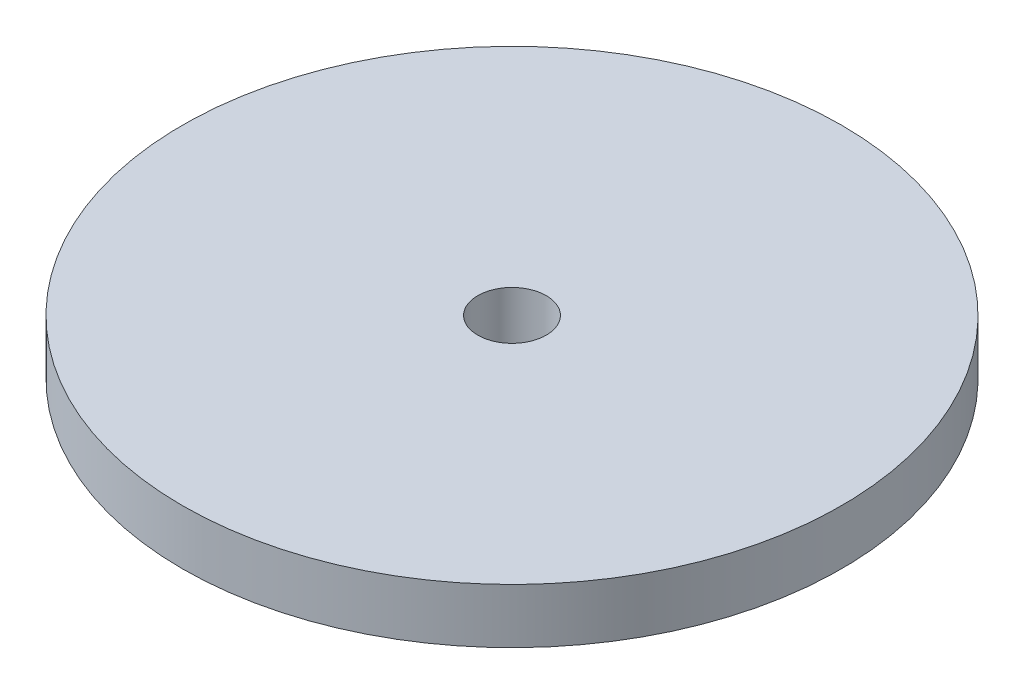
ISO-10303-21;
HEADER;
FILE_DESCRIPTION(('STEP AP214'),'2;1');
FILE_NAME('part.step','',(''),(''),'','','');
FILE_SCHEMA(('AUTOMOTIVE_DESIGN { 1 0 10303 214 1 1 1 1 }'));
ENDSEC;
DATA;
#1=APPLICATION_CONTEXT('core data for automotive mechanical design processes');
#2=APPLICATION_PROTOCOL_DEFINITION('international standard','automotive_design',2000,#1);
#3=PRODUCT_CONTEXT('',#1,'mechanical');
#4=PRODUCT('Part','Part','',(#3));
#5=PRODUCT_RELATED_PRODUCT_CATEGORY('part','',(#4));
#6=PRODUCT_DEFINITION_FORMATION('','',#4);
#7=PRODUCT_DEFINITION_CONTEXT('part definition',#1,'design');
#8=PRODUCT_DEFINITION('design','',#6,#7);
#9=PRODUCT_DEFINITION_SHAPE('','',#8);
#10=(LENGTH_UNIT() NAMED_UNIT(*) SI_UNIT(.MILLI.,.METRE.));
#11=(NAMED_UNIT(*) PLANE_ANGLE_UNIT() SI_UNIT($,.RADIAN.));
#12=(NAMED_UNIT(*) SI_UNIT($,.STERADIAN.) SOLID_ANGLE_UNIT());
#13=UNCERTAINTY_MEASURE_WITH_UNIT(LENGTH_MEASURE(1.E-05),#10,'distance_accuracy_value','');
#14=(GEOMETRIC_REPRESENTATION_CONTEXT(3) GLOBAL_UNCERTAINTY_ASSIGNED_CONTEXT((#13)) GLOBAL_UNIT_ASSIGNED_CONTEXT((#10,
#11,#12)) REPRESENTATION_CONTEXT('',''));
#15=CARTESIAN_POINT('',(0.,0.,0.));
#16=DIRECTION('',(0.,0.,1.));
#17=DIRECTION('',(1.,0.,0.));
#18=AXIS2_PLACEMENT_3D('',#15,#16,#17);
#19=CARTESIAN_POINT('',(0.,6.35,0.));
#20=DIRECTION('',(0.,-1.,0.));
#21=DIRECTION('',(0.,0.,-1.));
#22=AXIS2_PLACEMENT_3D('',#19,#20,#21);
#23=CYLINDRICAL_SURFACE('',#22,38.227);
#24=CARTESIAN_POINT('',(0.,6.35,0.));
#25=DIRECTION('',(0.,1.,0.));
#26=DIRECTION('',(0.,0.,1.));
#27=AXIS2_PLACEMENT_3D('',#24,#25,#26);
#28=CIRCLE('',#27,38.227);
#29=CARTESIAN_POINT('',(0.,6.35,38.227));
#30=VERTEX_POINT('',#29);
#31=EDGE_CURVE('E10',#30,#30,#28,.T.);
#32=ORIENTED_EDGE('',*,*,#31,.F.);
#33=EDGE_LOOP('',(#32));
#34=FACE_BOUND('',#33,.T.);
#35=CARTESIAN_POINT('',(0.,0.,0.));
#36=DIRECTION('',(0.,1.,0.));
#37=DIRECTION('',(0.,0.,1.));
#38=AXIS2_PLACEMENT_3D('',#35,#36,#37);
#39=CIRCLE('',#38,38.227);
#40=CARTESIAN_POINT('',(0.,0.,38.227));
#41=VERTEX_POINT('',#40);
#42=EDGE_CURVE('E36',#41,#41,#39,.T.);
#43=ORIENTED_EDGE('',*,*,#42,.T.);
#44=EDGE_LOOP('',(#43));
#45=FACE_BOUND('',#44,.T.);
#46=ADVANCED_FACE('F33',(#34,#45),#23,.T.);
#47=CARTESIAN_POINT('',(0.,6.35,0.));
#48=DIRECTION('',(0.,1.,0.));
#49=DIRECTION('',(0.,0.,1.));
#50=AXIS2_PLACEMENT_3D('',#47,#48,#49);
#51=PLANE('',#50);
#52=CARTESIAN_POINT('',(0.,6.35,0.));
#53=DIRECTION('',(0.,1.,0.));
#54=DIRECTION('',(0.,0.,1.));
#55=AXIS2_PLACEMENT_3D('',#52,#53,#54);
#56=CIRCLE('',#55,3.9751);
#57=CARTESIAN_POINT('',(0.,6.35,3.9751));
#58=VERTEX_POINT('',#57);
#59=EDGE_CURVE('E45',#58,#58,#56,.T.);
#60=ORIENTED_EDGE('',*,*,#59,.F.);
#61=EDGE_LOOP('',(#60));
#62=FACE_BOUND('',#61,.T.);
#63=ORIENTED_EDGE('',*,*,#31,.T.);
#64=EDGE_LOOP('',(#63));
#65=FACE_BOUND('',#64,.T.);
#66=ADVANCED_FACE('F60',(#62,#65),#51,.T.);
#67=CARTESIAN_POINT('',(0.,0.,0.));
#68=DIRECTION('',(0.,1.,0.));
#69=DIRECTION('',(0.,0.,1.));
#70=AXIS2_PLACEMENT_3D('',#67,#68,#69);
#71=PLANE('',#70);
#72=CARTESIAN_POINT('',(0.,0.,0.));
#73=DIRECTION('',(0.,1.,0.));
#74=DIRECTION('',(0.,0.,1.));
#75=AXIS2_PLACEMENT_3D('',#72,#73,#74);
#76=CIRCLE('',#75,3.9751);
#77=CARTESIAN_POINT('',(0.,0.,3.9751));
#78=VERTEX_POINT('',#77);
#79=EDGE_CURVE('E43',#78,#78,#76,.T.);
#80=ORIENTED_EDGE('',*,*,#79,.T.);
#81=EDGE_LOOP('',(#80));
#82=FACE_BOUND('',#81,.T.);
#83=ORIENTED_EDGE('',*,*,#42,.F.);
#84=EDGE_LOOP('',(#83));
#85=FACE_BOUND('',#84,.T.);
#86=ADVANCED_FACE('F51',(#82,#85),#71,.F.);
#87=CARTESIAN_POINT('',(0.,0.,0.));
#88=DIRECTION('',(0.,1.,0.));
#89=DIRECTION('',(0.,0.,1.));
#90=AXIS2_PLACEMENT_3D('',#87,#88,#89);
#91=CYLINDRICAL_SURFACE('',#90,3.9751);
#92=ORIENTED_EDGE('',*,*,#79,.F.);
#93=EDGE_LOOP('',(#92));
#94=FACE_BOUND('',#93,.T.);
#95=ORIENTED_EDGE('',*,*,#59,.T.);
#96=EDGE_LOOP('',(#95));
#97=FACE_BOUND('',#96,.T.);
#98=ADVANCED_FACE('F54',(#94,#97),#91,.F.);
#99=CLOSED_SHELL('',(#46,#66,#86,#98));
#100=MANIFOLD_SOLID_BREP('B2',#99);
#101=ADVANCED_BREP_SHAPE_REPRESENTATION('',(#18,#100),#14);
#102=SHAPE_DEFINITION_REPRESENTATION(#9,#101);
ENDSEC;
END-ISO-10303-21;
